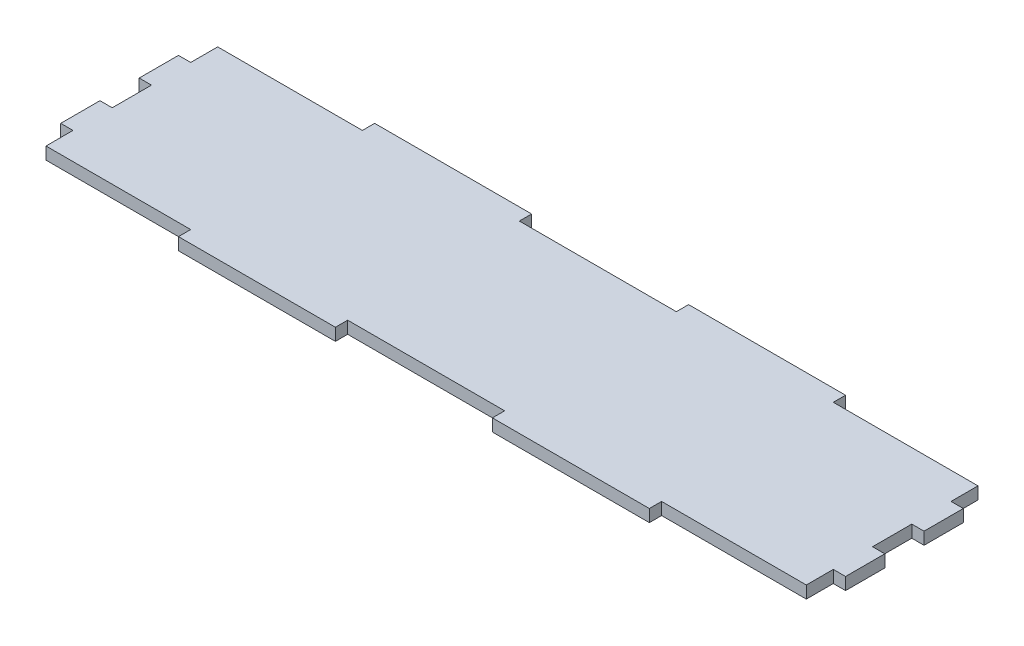
ISO-10303-21;
HEADER;
FILE_DESCRIPTION(('STEP AP214'),'2;1');
FILE_NAME('part.step','',(''),(''),'','','');
FILE_SCHEMA(('AUTOMOTIVE_DESIGN { 1 0 10303 214 1 1 1 1 }'));
ENDSEC;
DATA;
#1=APPLICATION_CONTEXT('core data for automotive mechanical design processes');
#2=APPLICATION_PROTOCOL_DEFINITION('international standard','automotive_design',2000,#1);
#3=PRODUCT_CONTEXT('',#1,'mechanical');
#4=PRODUCT('Part','Part','',(#3));
#5=PRODUCT_RELATED_PRODUCT_CATEGORY('part','',(#4));
#6=PRODUCT_DEFINITION_FORMATION('','',#4);
#7=PRODUCT_DEFINITION_CONTEXT('part definition',#1,'design');
#8=PRODUCT_DEFINITION('design','',#6,#7);
#9=PRODUCT_DEFINITION_SHAPE('','',#8);
#10=(LENGTH_UNIT() NAMED_UNIT(*) SI_UNIT(.MILLI.,.METRE.));
#11=(NAMED_UNIT(*) PLANE_ANGLE_UNIT() SI_UNIT($,.RADIAN.));
#12=(NAMED_UNIT(*) SI_UNIT($,.STERADIAN.) SOLID_ANGLE_UNIT());
#13=UNCERTAINTY_MEASURE_WITH_UNIT(LENGTH_MEASURE(1.E-05),#10,'distance_accuracy_value','');
#14=(GEOMETRIC_REPRESENTATION_CONTEXT(3) GLOBAL_UNCERTAINTY_ASSIGNED_CONTEXT((#13)) GLOBAL_UNIT_ASSIGNED_CONTEXT((#10,
#11,#12)) REPRESENTATION_CONTEXT('',''));
#15=CARTESIAN_POINT('',(0.,0.,0.));
#16=DIRECTION('',(0.,0.,1.));
#17=DIRECTION('',(1.,0.,0.));
#18=AXIS2_PLACEMENT_3D('',#15,#16,#17);
#19=CARTESIAN_POINT('',(101.6,3.175,25.4));
#20=DIRECTION('',(-1.,0.,0.));
#21=DIRECTION('',(0.,0.,1.));
#22=AXIS2_PLACEMENT_3D('',#19,#20,#21);
#23=PLANE('',#22);
#24=DIRECTION('',(0.,0.,-1.));
#25=VECTOR('',#24,1.);
#26=CARTESIAN_POINT('',(101.6,3.175,25.4));
#27=LINE('',#26,#25);
#28=CARTESIAN_POINT('',(101.6,3.175,15.24));
#29=VERTEX_POINT('',#28);
#30=CARTESIAN_POINT('',(101.6,3.175,5.07999999999621));
#31=VERTEX_POINT('',#30);
#32=EDGE_CURVE('E398',#29,#31,#27,.T.);
#33=ORIENTED_EDGE('',*,*,#32,.F.);
#34=DIRECTION('',(0.,1.,0.));
#35=VECTOR('',#34,1.);
#36=CARTESIAN_POINT('',(101.6,0.,15.24));
#37=LINE('',#36,#35);
#38=CARTESIAN_POINT('',(101.6,0.,15.24));
#39=VERTEX_POINT('',#38);
#40=EDGE_CURVE('E465',#39,#29,#37,.T.);
#41=ORIENTED_EDGE('',*,*,#40,.F.);
#42=DIRECTION('',(0.,0.,-1.));
#43=VECTOR('',#42,1.);
#44=CARTESIAN_POINT('',(101.6,0.,25.4));
#45=LINE('',#44,#43);
#46=CARTESIAN_POINT('',(101.6,0.,5.07999999999621));
#47=VERTEX_POINT('',#46);
#48=EDGE_CURVE('E407',#39,#47,#45,.T.);
#49=ORIENTED_EDGE('',*,*,#48,.T.);
#50=DIRECTION('',(0.,1.,0.));
#51=VECTOR('',#50,1.);
#52=CARTESIAN_POINT('',(101.6,0.,5.07999999999621));
#53=LINE('',#52,#51);
#54=EDGE_CURVE('E484',#47,#31,#53,.T.);
#55=ORIENTED_EDGE('',*,*,#54,.T.);
#56=EDGE_LOOP('',(#33,#41,#49,#55));
#57=FACE_BOUND('',#56,.T.);
#58=ADVANCED_FACE('F34',(#57),#23,.F.);
#59=CARTESIAN_POINT('',(-101.6,3.175,25.4));
#60=DIRECTION('',(1.,0.,0.));
#61=DIRECTION('',(0.,0.,-1.));
#62=AXIS2_PLACEMENT_3D('',#59,#60,#61);
#63=PLANE('',#62);
#64=DIRECTION('',(0.,0.,1.));
#65=VECTOR('',#64,1.);
#66=CARTESIAN_POINT('',(-101.6,3.175,25.4));
#67=LINE('',#66,#65);
#68=CARTESIAN_POINT('',(-101.6,3.175,-15.24));
#69=VERTEX_POINT('',#68);
#70=CARTESIAN_POINT('',(-101.6,3.175,-5.08));
#71=VERTEX_POINT('',#70);
#72=EDGE_CURVE('E284',#69,#71,#67,.T.);
#73=ORIENTED_EDGE('',*,*,#72,.F.);
#74=DIRECTION('',(0.,1.,0.));
#75=VECTOR('',#74,1.);
#76=CARTESIAN_POINT('',(-101.6,0.,-15.24));
#77=LINE('',#76,#75);
#78=CARTESIAN_POINT('',(-101.6,0.,-15.24));
#79=VERTEX_POINT('',#78);
#80=EDGE_CURVE('E269',#79,#69,#77,.T.);
#81=ORIENTED_EDGE('',*,*,#80,.F.);
#82=DIRECTION('',(0.,0.,1.));
#83=VECTOR('',#82,1.);
#84=CARTESIAN_POINT('',(-101.6,0.,25.4));
#85=LINE('',#84,#83);
#86=CARTESIAN_POINT('',(-101.6,0.,-5.08));
#87=VERTEX_POINT('',#86);
#88=EDGE_CURVE('E282',#79,#87,#85,.T.);
#89=ORIENTED_EDGE('',*,*,#88,.T.);
#90=DIRECTION('',(0.,1.,0.));
#91=VECTOR('',#90,1.);
#92=CARTESIAN_POINT('',(-101.6,0.,-5.08));
#93=LINE('',#92,#91);
#94=EDGE_CURVE('E489',#87,#71,#93,.T.);
#95=ORIENTED_EDGE('',*,*,#94,.T.);
#96=EDGE_LOOP('',(#73,#81,#89,#95));
#97=FACE_BOUND('',#96,.T.);
#98=ADVANCED_FACE('F280',(#97),#63,.F.);
#99=CARTESIAN_POINT('',(-101.6,3.175,-25.4));
#100=DIRECTION('',(0.,0.,1.));
#101=DIRECTION('',(1.,0.,0.));
#102=AXIS2_PLACEMENT_3D('',#99,#100,#101);
#103=PLANE('',#102);
#104=DIRECTION('',(-1.,0.,0.));
#105=VECTOR('',#104,1.);
#106=CARTESIAN_POINT('',(-101.6,3.175,-25.4));
#107=LINE('',#106,#105);
#108=CARTESIAN_POINT('',(-20.32,3.175,-25.4));
#109=VERTEX_POINT('',#108);
#110=CARTESIAN_POINT('',(-60.96,3.175,-25.4));
#111=VERTEX_POINT('',#110);
#112=EDGE_CURVE('E400',#109,#111,#107,.T.);
#113=ORIENTED_EDGE('',*,*,#112,.F.);
#114=DIRECTION('',(0.,1.,0.));
#115=VECTOR('',#114,1.);
#116=CARTESIAN_POINT('',(-20.32,0.,-25.4));
#117=LINE('',#116,#115);
#118=CARTESIAN_POINT('',(-20.32,0.,-25.4));
#119=VERTEX_POINT('',#118);
#120=EDGE_CURVE('E357',#119,#109,#117,.T.);
#121=ORIENTED_EDGE('',*,*,#120,.F.);
#122=DIRECTION('',(-1.,0.,0.));
#123=VECTOR('',#122,1.);
#124=CARTESIAN_POINT('',(-101.6,0.,-25.4));
#125=LINE('',#124,#123);
#126=CARTESIAN_POINT('',(-60.96,0.,-25.4));
#127=VERTEX_POINT('',#126);
#128=EDGE_CURVE('E300',#119,#127,#125,.T.);
#129=ORIENTED_EDGE('',*,*,#128,.T.);
#130=DIRECTION('',(0.,1.,0.));
#131=VECTOR('',#130,1.);
#132=CARTESIAN_POINT('',(-60.96,0.,-25.4));
#133=LINE('',#132,#131);
#134=EDGE_CURVE('E378',#127,#111,#133,.T.);
#135=ORIENTED_EDGE('',*,*,#134,.T.);
#136=EDGE_LOOP('',(#113,#121,#129,#135));
#137=FACE_BOUND('',#136,.T.);
#138=ADVANCED_FACE('F626',(#137),#103,.F.);
#139=CARTESIAN_POINT('',(-101.6,3.175,25.4));
#140=DIRECTION('',(0.,0.,-1.));
#141=DIRECTION('',(-1.,0.,0.));
#142=AXIS2_PLACEMENT_3D('',#139,#140,#141);
#143=PLANE('',#142);
#144=DIRECTION('',(1.,0.,0.));
#145=VECTOR('',#144,1.);
#146=CARTESIAN_POINT('',(-101.6,0.,25.4));
#147=LINE('',#146,#145);
#148=CARTESIAN_POINT('',(-60.96,0.,25.4));
#149=VERTEX_POINT('',#148);
#150=CARTESIAN_POINT('',(-20.32,0.,25.4));
#151=VERTEX_POINT('',#150);
#152=EDGE_CURVE('E295',#149,#151,#147,.T.);
#153=ORIENTED_EDGE('',*,*,#152,.T.);
#154=DIRECTION('',(0.,1.,0.));
#155=VECTOR('',#154,1.);
#156=CARTESIAN_POINT('',(-20.32,0.,25.4));
#157=LINE('',#156,#155);
#158=CARTESIAN_POINT('',(-20.32,3.175,25.4));
#159=VERTEX_POINT('',#158);
#160=EDGE_CURVE('E540',#151,#159,#157,.T.);
#161=ORIENTED_EDGE('',*,*,#160,.T.);
#162=DIRECTION('',(1.,0.,0.));
#163=VECTOR('',#162,1.);
#164=CARTESIAN_POINT('',(-101.6,3.175,25.4));
#165=LINE('',#164,#163);
#166=CARTESIAN_POINT('',(-60.96,3.175,25.4));
#167=VERTEX_POINT('',#166);
#168=EDGE_CURVE('E309',#167,#159,#165,.T.);
#169=ORIENTED_EDGE('',*,*,#168,.F.);
#170=DIRECTION('',(0.,1.,0.));
#171=VECTOR('',#170,1.);
#172=CARTESIAN_POINT('',(-60.96,0.,25.4));
#173=LINE('',#172,#171);
#174=EDGE_CURVE('E391',#149,#167,#173,.T.);
#175=ORIENTED_EDGE('',*,*,#174,.F.);
#176=EDGE_LOOP('',(#153,#161,#169,#175));
#177=FACE_BOUND('',#176,.T.);
#178=ADVANCED_FACE('F554',(#177),#143,.F.);
#179=CARTESIAN_POINT('',(101.6,0.,-5.08));
#180=VERTEX_POINT('',#179);
#181=CARTESIAN_POINT('',(101.6,0.,-15.2400000000038));
#182=VERTEX_POINT('',#181);
#183=EDGE_CURVE('E381',#180,#182,#45,.T.);
#184=ORIENTED_EDGE('',*,*,#183,.T.);
#185=DIRECTION('',(0.,1.,0.));
#186=VECTOR('',#185,1.);
#187=CARTESIAN_POINT('',(101.6,0.,-15.2400000000038));
#188=LINE('',#187,#186);
#189=CARTESIAN_POINT('',(101.6,3.175,-15.2400000000038));
#190=VERTEX_POINT('',#189);
#191=EDGE_CURVE('E419',#182,#190,#188,.T.);
#192=ORIENTED_EDGE('',*,*,#191,.T.);
#193=CARTESIAN_POINT('',(101.6,3.175,-5.08));
#194=VERTEX_POINT('',#193);
#195=EDGE_CURVE('E304',#194,#190,#27,.T.);
#196=ORIENTED_EDGE('',*,*,#195,.F.);
#197=DIRECTION('',(0.,1.,0.));
#198=VECTOR('',#197,1.);
#199=CARTESIAN_POINT('',(101.6,0.,-5.08));
#200=LINE('',#199,#198);
#201=EDGE_CURVE('E421',#180,#194,#200,.T.);
#202=ORIENTED_EDGE('',*,*,#201,.F.);
#203=EDGE_LOOP('',(#184,#192,#196,#202));
#204=FACE_BOUND('',#203,.T.);
#205=ADVANCED_FACE('F36',(#204),#23,.F.);
#206=CARTESIAN_POINT('',(60.96,3.175,-25.4));
#207=VERTEX_POINT('',#206);
#208=CARTESIAN_POINT('',(20.32,3.175,-25.4));
#209=VERTEX_POINT('',#208);
#210=EDGE_CURVE('E402',#207,#209,#107,.T.);
#211=ORIENTED_EDGE('',*,*,#210,.F.);
#212=DIRECTION('',(0.,1.,0.));
#213=VECTOR('',#212,1.);
#214=CARTESIAN_POINT('',(60.96,0.,-25.4));
#215=LINE('',#214,#213);
#216=CARTESIAN_POINT('',(60.96,0.,-25.4));
#217=VERTEX_POINT('',#216);
#218=EDGE_CURVE('E326',#217,#207,#215,.T.);
#219=ORIENTED_EDGE('',*,*,#218,.F.);
#220=CARTESIAN_POINT('',(20.32,0.,-25.4));
#221=VERTEX_POINT('',#220);
#222=EDGE_CURVE('E298',#217,#221,#125,.T.);
#223=ORIENTED_EDGE('',*,*,#222,.T.);
#224=DIRECTION('',(0.,1.,0.));
#225=VECTOR('',#224,1.);
#226=CARTESIAN_POINT('',(20.32,0.,-25.4));
#227=LINE('',#226,#225);
#228=EDGE_CURVE('E360',#221,#209,#227,.T.);
#229=ORIENTED_EDGE('',*,*,#228,.T.);
#230=EDGE_LOOP('',(#211,#219,#223,#229));
#231=FACE_BOUND('',#230,.T.);
#232=ADVANCED_FACE('F630',(#231),#103,.F.);
#233=CARTESIAN_POINT('',(-101.6,0.,5.08));
#234=VERTEX_POINT('',#233);
#235=CARTESIAN_POINT('',(-101.6,0.,15.24));
#236=VERTEX_POINT('',#235);
#237=EDGE_CURVE('E292',#234,#236,#85,.T.);
#238=ORIENTED_EDGE('',*,*,#237,.T.);
#239=DIRECTION('',(0.,1.,0.));
#240=VECTOR('',#239,1.);
#241=CARTESIAN_POINT('',(-101.6,0.,15.24));
#242=LINE('',#241,#240);
#243=CARTESIAN_POINT('',(-101.6,3.175,15.24));
#244=VERTEX_POINT('',#243);
#245=EDGE_CURVE('E452',#236,#244,#242,.T.);
#246=ORIENTED_EDGE('',*,*,#245,.T.);
#247=CARTESIAN_POINT('',(-101.6,3.175,5.08));
#248=VERTEX_POINT('',#247);
#249=EDGE_CURVE('E405',#248,#244,#67,.T.);
#250=ORIENTED_EDGE('',*,*,#249,.F.);
#251=DIRECTION('',(0.,1.,0.));
#252=VECTOR('',#251,1.);
#253=CARTESIAN_POINT('',(-101.6,0.,5.08));
#254=LINE('',#253,#252);
#255=EDGE_CURVE('E479',#234,#248,#254,.T.);
#256=ORIENTED_EDGE('',*,*,#255,.F.);
#257=EDGE_LOOP('',(#238,#246,#250,#256));
#258=FACE_BOUND('',#257,.T.);
#259=ADVANCED_FACE('F628',(#258),#63,.F.);
#260=CARTESIAN_POINT('',(20.32,3.175,25.4));
#261=VERTEX_POINT('',#260);
#262=CARTESIAN_POINT('',(60.96,3.175,25.4));
#263=VERTEX_POINT('',#262);
#264=EDGE_CURVE('E404',#261,#263,#165,.T.);
#265=ORIENTED_EDGE('',*,*,#264,.F.);
#266=DIRECTION('',(0.,1.,0.));
#267=VECTOR('',#266,1.);
#268=CARTESIAN_POINT('',(20.32,0.,25.4));
#269=LINE('',#268,#267);
#270=CARTESIAN_POINT('',(20.32,0.,25.4));
#271=VERTEX_POINT('',#270);
#272=EDGE_CURVE('E550',#271,#261,#269,.T.);
#273=ORIENTED_EDGE('',*,*,#272,.F.);
#274=CARTESIAN_POINT('',(60.96,0.,25.4));
#275=VERTEX_POINT('',#274);
#276=EDGE_CURVE('E291',#271,#275,#147,.T.);
#277=ORIENTED_EDGE('',*,*,#276,.T.);
#278=DIRECTION('',(0.,1.,0.));
#279=VECTOR('',#278,1.);
#280=CARTESIAN_POINT('',(60.96,0.,25.4));
#281=LINE('',#280,#279);
#282=EDGE_CURVE('E523',#275,#263,#281,.T.);
#283=ORIENTED_EDGE('',*,*,#282,.T.);
#284=EDGE_LOOP('',(#265,#273,#277,#283));
#285=FACE_BOUND('',#284,.T.);
#286=ADVANCED_FACE('F581',(#285),#143,.F.);
#287=CARTESIAN_POINT('',(0.,3.175,0.));
#288=DIRECTION('',(0.,-1.,0.));
#289=DIRECTION('',(0.,0.,-1.));
#290=AXIS2_PLACEMENT_3D('',#287,#288,#289);
#291=PLANE('',#290);
#292=DIRECTION('',(1.,0.,0.));
#293=VECTOR('',#292,1.);
#294=CARTESIAN_POINT('',(-101.6,3.175,-22.225));
#295=LINE('',#294,#293);
#296=CARTESIAN_POINT('',(-98.425,3.175,-22.225));
#297=VERTEX_POINT('',#296);
#298=CARTESIAN_POINT('',(-60.96,3.175,-22.225));
#299=VERTEX_POINT('',#298);
#300=EDGE_CURVE('E373',#297,#299,#295,.T.);
#301=ORIENTED_EDGE('',*,*,#300,.F.);
#302=DIRECTION('',(0.,0.,-1.));
#303=VECTOR('',#302,1.);
#304=CARTESIAN_POINT('',(-98.425,3.175,-25.4));
#305=LINE('',#304,#303);
#306=CARTESIAN_POINT('',(-98.425,3.175,-15.24));
#307=VERTEX_POINT('',#306);
#308=EDGE_CURVE('E49',#307,#297,#305,.T.);
#309=ORIENTED_EDGE('',*,*,#308,.F.);
#310=DIRECTION('',(1.,0.,0.));
#311=VECTOR('',#310,1.);
#312=CARTESIAN_POINT('',(-101.6,3.175,-15.24));
#313=LINE('',#312,#311);
#314=EDGE_CURVE('E438',#69,#307,#313,.T.);
#315=ORIENTED_EDGE('',*,*,#314,.F.);
#316=ORIENTED_EDGE('',*,*,#72,.T.);
#317=DIRECTION('',(-1.,0.,0.));
#318=VECTOR('',#317,1.);
#319=CARTESIAN_POINT('',(-101.6,3.175,-5.08));
#320=LINE('',#319,#318);
#321=CARTESIAN_POINT('',(-98.425,3.175,-5.08));
#322=VERTEX_POINT('',#321);
#323=EDGE_CURVE('E476',#322,#71,#320,.T.);
#324=ORIENTED_EDGE('',*,*,#323,.F.);
#325=DIRECTION('',(0.,0.,-1.));
#326=VECTOR('',#325,1.);
#327=CARTESIAN_POINT('',(-98.425,3.175,-5.08));
#328=LINE('',#327,#326);
#329=CARTESIAN_POINT('',(-98.425,3.175,5.08));
#330=VERTEX_POINT('',#329);
#331=EDGE_CURVE('E483',#330,#322,#328,.T.);
#332=ORIENTED_EDGE('',*,*,#331,.F.);
#333=DIRECTION('',(1.,0.,0.));
#334=VECTOR('',#333,1.);
#335=CARTESIAN_POINT('',(-101.6,3.175,5.08));
#336=LINE('',#335,#334);
#337=EDGE_CURVE('E480',#248,#330,#336,.T.);
#338=ORIENTED_EDGE('',*,*,#337,.F.);
#339=ORIENTED_EDGE('',*,*,#249,.T.);
#340=DIRECTION('',(-1.,0.,0.));
#341=VECTOR('',#340,1.);
#342=CARTESIAN_POINT('',(-101.6,3.175,15.24));
#343=LINE('',#342,#341);
#344=CARTESIAN_POINT('',(-98.425,3.175,15.24));
#345=VERTEX_POINT('',#344);
#346=EDGE_CURVE('E444',#345,#244,#343,.T.);
#347=ORIENTED_EDGE('',*,*,#346,.F.);
#348=DIRECTION('',(0.,0.,-1.));
#349=VECTOR('',#348,1.);
#350=CARTESIAN_POINT('',(-98.425,3.175,15.24));
#351=LINE('',#350,#349);
#352=CARTESIAN_POINT('',(-98.425,3.175,22.225));
#353=VERTEX_POINT('',#352);
#354=EDGE_CURVE('E448',#353,#345,#351,.T.);
#355=ORIENTED_EDGE('',*,*,#354,.F.);
#356=DIRECTION('',(-1.,0.,0.));
#357=VECTOR('',#356,1.);
#358=CARTESIAN_POINT('',(-101.6,3.175,22.225));
#359=LINE('',#358,#357);
#360=CARTESIAN_POINT('',(-60.96,3.175,22.225));
#361=VERTEX_POINT('',#360);
#362=EDGE_CURVE('E388',#361,#353,#359,.T.);
#363=ORIENTED_EDGE('',*,*,#362,.F.);
#364=DIRECTION('',(0.,0.,-1.));
#365=VECTOR('',#364,1.);
#366=CARTESIAN_POINT('',(-60.96,3.175,25.4));
#367=LINE('',#366,#365);
#368=EDGE_CURVE('E359',#167,#361,#367,.T.);
#369=ORIENTED_EDGE('',*,*,#368,.F.);
#370=ORIENTED_EDGE('',*,*,#168,.T.);
#371=DIRECTION('',(0.,0.,1.));
#372=VECTOR('',#371,1.);
#373=CARTESIAN_POINT('',(-20.32,3.175,25.4));
#374=LINE('',#373,#372);
#375=CARTESIAN_POINT('',(-20.32,3.175,22.225));
#376=VERTEX_POINT('',#375);
#377=EDGE_CURVE('E336',#376,#159,#374,.T.);
#378=ORIENTED_EDGE('',*,*,#377,.F.);
#379=DIRECTION('',(-1.,0.,0.));
#380=VECTOR('',#379,1.);
#381=CARTESIAN_POINT('',(-20.32,3.175,22.225));
#382=LINE('',#381,#380);
#383=CARTESIAN_POINT('',(20.32,3.175,22.225));
#384=VERTEX_POINT('',#383);
#385=EDGE_CURVE('E534',#384,#376,#382,.T.);
#386=ORIENTED_EDGE('',*,*,#385,.F.);
#387=DIRECTION('',(0.,0.,-1.));
#388=VECTOR('',#387,1.);
#389=CARTESIAN_POINT('',(20.32,3.175,25.4));
#390=LINE('',#389,#388);
#391=EDGE_CURVE('E542',#261,#384,#390,.T.);
#392=ORIENTED_EDGE('',*,*,#391,.F.);
#393=ORIENTED_EDGE('',*,*,#264,.T.);
#394=DIRECTION('',(0.,0.,1.));
#395=VECTOR('',#394,1.);
#396=CARTESIAN_POINT('',(60.96,3.175,25.4));
#397=LINE('',#396,#395);
#398=CARTESIAN_POINT('',(60.96,3.175,22.225));
#399=VERTEX_POINT('',#398);
#400=EDGE_CURVE('E491',#399,#263,#397,.T.);
#401=ORIENTED_EDGE('',*,*,#400,.F.);
#402=DIRECTION('',(-1.,0.,0.));
#403=VECTOR('',#402,1.);
#404=CARTESIAN_POINT('',(60.96,3.175,22.225));
#405=LINE('',#404,#403);
#406=CARTESIAN_POINT('',(98.425,3.175,22.225));
#407=VERTEX_POINT('',#406);
#408=EDGE_CURVE('E521',#407,#399,#405,.T.);
#409=ORIENTED_EDGE('',*,*,#408,.F.);
#410=DIRECTION('',(0.,0.,1.));
#411=VECTOR('',#410,1.);
#412=CARTESIAN_POINT('',(98.425,3.175,25.3999999999962));
#413=LINE('',#412,#411);
#414=CARTESIAN_POINT('',(98.425,3.175,15.24));
#415=VERTEX_POINT('',#414);
#416=EDGE_CURVE('E462',#415,#407,#413,.T.);
#417=ORIENTED_EDGE('',*,*,#416,.F.);
#418=DIRECTION('',(-1.,0.,0.));
#419=VECTOR('',#418,1.);
#420=CARTESIAN_POINT('',(101.6,3.175,15.24));
#421=LINE('',#420,#419);
#422=EDGE_CURVE('E466',#29,#415,#421,.T.);
#423=ORIENTED_EDGE('',*,*,#422,.F.);
#424=ORIENTED_EDGE('',*,*,#32,.T.);
#425=DIRECTION('',(1.,0.,0.));
#426=VECTOR('',#425,1.);
#427=CARTESIAN_POINT('',(101.6,3.175,5.07999999999621));
#428=LINE('',#427,#426);
#429=CARTESIAN_POINT('',(98.425,3.175,5.07999999999621));
#430=VERTEX_POINT('',#429);
#431=EDGE_CURVE('E499',#430,#31,#428,.T.);
#432=ORIENTED_EDGE('',*,*,#431,.F.);
#433=DIRECTION('',(0.,0.,1.));
#434=VECTOR('',#433,1.);
#435=CARTESIAN_POINT('',(98.425,3.175,5.07999999999621));
#436=LINE('',#435,#434);
#437=CARTESIAN_POINT('',(98.425,3.175,-5.08));
#438=VERTEX_POINT('',#437);
#439=EDGE_CURVE('E506',#438,#430,#436,.T.);
#440=ORIENTED_EDGE('',*,*,#439,.F.);
#441=DIRECTION('',(-1.,0.,0.));
#442=VECTOR('',#441,1.);
#443=CARTESIAN_POINT('',(101.6,3.175,-5.08));
#444=LINE('',#443,#442);
#445=EDGE_CURVE('E455',#194,#438,#444,.T.);
#446=ORIENTED_EDGE('',*,*,#445,.F.);
#447=ORIENTED_EDGE('',*,*,#195,.T.);
#448=DIRECTION('',(1.,0.,0.));
#449=VECTOR('',#448,1.);
#450=CARTESIAN_POINT('',(101.6,3.175,-15.2400000000038));
#451=LINE('',#450,#449);
#452=CARTESIAN_POINT('',(98.425,3.175,-15.2400000000038));
#453=VERTEX_POINT('',#452);
#454=EDGE_CURVE('E432',#453,#190,#451,.T.);
#455=ORIENTED_EDGE('',*,*,#454,.F.);
#456=DIRECTION('',(0.,0.,1.));
#457=VECTOR('',#456,1.);
#458=CARTESIAN_POINT('',(98.425,3.175,-15.2400000000038));
#459=LINE('',#458,#457);
#460=CARTESIAN_POINT('',(98.425,3.175,-22.225));
#461=VERTEX_POINT('',#460);
#462=EDGE_CURVE('E435',#461,#453,#459,.T.);
#463=ORIENTED_EDGE('',*,*,#462,.F.);
#464=DIRECTION('',(1.,0.,0.));
#465=VECTOR('',#464,1.);
#466=CARTESIAN_POINT('',(60.96,3.175,-22.225));
#467=LINE('',#466,#465);
#468=CARTESIAN_POINT('',(60.96,3.175,-22.225));
#469=VERTEX_POINT('',#468);
#470=EDGE_CURVE('E319',#469,#461,#467,.T.);
#471=ORIENTED_EDGE('',*,*,#470,.F.);
#472=DIRECTION('',(0.,0.,1.));
#473=VECTOR('',#472,1.);
#474=CARTESIAN_POINT('',(60.96,3.175,-25.4));
#475=LINE('',#474,#473);
#476=EDGE_CURVE('E331',#207,#469,#475,.T.);
#477=ORIENTED_EDGE('',*,*,#476,.F.);
#478=ORIENTED_EDGE('',*,*,#210,.T.);
#479=DIRECTION('',(0.,0.,-1.));
#480=VECTOR('',#479,1.);
#481=CARTESIAN_POINT('',(20.32,3.175,-25.4));
#482=LINE('',#481,#480);
#483=CARTESIAN_POINT('',(20.32,3.175,-22.225));
#484=VERTEX_POINT('',#483);
#485=EDGE_CURVE('E342',#484,#209,#482,.T.);
#486=ORIENTED_EDGE('',*,*,#485,.F.);
#487=DIRECTION('',(1.,0.,0.));
#488=VECTOR('',#487,1.);
#489=CARTESIAN_POINT('',(-20.32,3.175,-22.225));
#490=LINE('',#489,#488);
#491=CARTESIAN_POINT('',(-20.32,3.175,-22.225));
#492=VERTEX_POINT('',#491);
#493=EDGE_CURVE('E352',#492,#484,#490,.T.);
#494=ORIENTED_EDGE('',*,*,#493,.F.);
#495=DIRECTION('',(0.,0.,1.));
#496=VECTOR('',#495,1.);
#497=CARTESIAN_POINT('',(-20.32,3.175,-25.4));
#498=LINE('',#497,#496);
#499=EDGE_CURVE('E349',#109,#492,#498,.T.);
#500=ORIENTED_EDGE('',*,*,#499,.F.);
#501=ORIENTED_EDGE('',*,*,#112,.T.);
#502=DIRECTION('',(0.,0.,-1.));
#503=VECTOR('',#502,1.);
#504=CARTESIAN_POINT('',(-60.96,3.175,-25.4));
#505=LINE('',#504,#503);
#506=EDGE_CURVE('E369',#299,#111,#505,.T.);
#507=ORIENTED_EDGE('',*,*,#506,.F.);
#508=EDGE_LOOP('',(#301,#309,#315,#316,#324,#332,#338,#339,#347,#355,#363,#369,#370,#378,#386,
#392,#393,#401,#409,#417,#423,#424,#432,#440,#446,#447,#455,#463,#471,#477,#478,#486,#494,#500,
#501,#507));
#509=FACE_BOUND('',#508,.T.);
#510=ADVANCED_FACE('F563',(#509),#291,.F.);
#511=CARTESIAN_POINT('',(0.,0.,0.));
#512=DIRECTION('',(0.,-1.,0.));
#513=DIRECTION('',(0.,0.,-1.));
#514=AXIS2_PLACEMENT_3D('',#511,#512,#513);
#515=PLANE('',#514);
#516=DIRECTION('',(0.,0.,-1.));
#517=VECTOR('',#516,1.);
#518=CARTESIAN_POINT('',(-98.425,0.,-25.4));
#519=LINE('',#518,#517);
#520=CARTESIAN_POINT('',(-98.425,0.,-15.24));
#521=VERTEX_POINT('',#520);
#522=CARTESIAN_POINT('',(-98.425,0.,-22.225));
#523=VERTEX_POINT('',#522);
#524=EDGE_CURVE('E276',#521,#523,#519,.T.);
#525=ORIENTED_EDGE('',*,*,#524,.T.);
#526=DIRECTION('',(1.,0.,0.));
#527=VECTOR('',#526,1.);
#528=CARTESIAN_POINT('',(-101.6,0.,-22.225));
#529=LINE('',#528,#527);
#530=CARTESIAN_POINT('',(-60.96,0.,-22.225));
#531=VERTEX_POINT('',#530);
#532=EDGE_CURVE('E366',#523,#531,#529,.T.);
#533=ORIENTED_EDGE('',*,*,#532,.T.);
#534=DIRECTION('',(0.,0.,-1.));
#535=VECTOR('',#534,1.);
#536=CARTESIAN_POINT('',(-60.96,0.,-25.4));
#537=LINE('',#536,#535);
#538=EDGE_CURVE('E368',#531,#127,#537,.T.);
#539=ORIENTED_EDGE('',*,*,#538,.T.);
#540=ORIENTED_EDGE('',*,*,#128,.F.);
#541=DIRECTION('',(0.,0.,1.));
#542=VECTOR('',#541,1.);
#543=CARTESIAN_POINT('',(-20.32,0.,-25.4));
#544=LINE('',#543,#542);
#545=CARTESIAN_POINT('',(-20.32,0.,-22.225));
#546=VERTEX_POINT('',#545);
#547=EDGE_CURVE('E338',#119,#546,#544,.T.);
#548=ORIENTED_EDGE('',*,*,#547,.T.);
#549=DIRECTION('',(1.,0.,0.));
#550=VECTOR('',#549,1.);
#551=CARTESIAN_POINT('',(-20.32,0.,-22.225));
#552=LINE('',#551,#550);
#553=CARTESIAN_POINT('',(20.32,0.,-22.225));
#554=VERTEX_POINT('',#553);
#555=EDGE_CURVE('E341',#546,#554,#552,.T.);
#556=ORIENTED_EDGE('',*,*,#555,.T.);
#557=DIRECTION('',(0.,0.,-1.));
#558=VECTOR('',#557,1.);
#559=CARTESIAN_POINT('',(20.32,0.,-25.4));
#560=LINE('',#559,#558);
#561=EDGE_CURVE('E345',#554,#221,#560,.T.);
#562=ORIENTED_EDGE('',*,*,#561,.T.);
#563=ORIENTED_EDGE('',*,*,#222,.F.);
#564=DIRECTION('',(0.,0.,1.));
#565=VECTOR('',#564,1.);
#566=CARTESIAN_POINT('',(60.96,0.,-25.4));
#567=LINE('',#566,#565);
#568=CARTESIAN_POINT('',(60.96,0.,-22.225));
#569=VERTEX_POINT('',#568);
#570=EDGE_CURVE('E323',#217,#569,#567,.T.);
#571=ORIENTED_EDGE('',*,*,#570,.T.);
#572=DIRECTION('',(1.,0.,0.));
#573=VECTOR('',#572,1.);
#574=CARTESIAN_POINT('',(60.96,0.,-22.225));
#575=LINE('',#574,#573);
#576=CARTESIAN_POINT('',(98.425,0.,-22.225));
#577=VERTEX_POINT('',#576);
#578=EDGE_CURVE('E316',#569,#577,#575,.T.);
#579=ORIENTED_EDGE('',*,*,#578,.T.);
#580=DIRECTION('',(0.,0.,1.));
#581=VECTOR('',#580,1.);
#582=CARTESIAN_POINT('',(98.425,0.,-15.2400000000038));
#583=LINE('',#582,#581);
#584=CARTESIAN_POINT('',(98.425,0.,-15.2400000000038));
#585=VERTEX_POINT('',#584);
#586=EDGE_CURVE('E56',#577,#585,#583,.T.);
#587=ORIENTED_EDGE('',*,*,#586,.T.);
#588=DIRECTION('',(1.,0.,0.));
#589=VECTOR('',#588,1.);
#590=CARTESIAN_POINT('',(101.6,0.,-15.2400000000038));
#591=LINE('',#590,#589);
#592=EDGE_CURVE('E426',#585,#182,#591,.T.);
#593=ORIENTED_EDGE('',*,*,#592,.T.);
#594=ORIENTED_EDGE('',*,*,#183,.F.);
#595=DIRECTION('',(-1.,0.,0.));
#596=VECTOR('',#595,1.);
#597=CARTESIAN_POINT('',(101.6,0.,-5.08));
#598=LINE('',#597,#596);
#599=CARTESIAN_POINT('',(98.425,0.,-5.08));
#600=VERTEX_POINT('',#599);
#601=EDGE_CURVE('E424',#180,#600,#598,.T.);
#602=ORIENTED_EDGE('',*,*,#601,.T.);
#603=DIRECTION('',(0.,0.,1.));
#604=VECTOR('',#603,1.);
#605=CARTESIAN_POINT('',(98.425,0.,5.07999999999621));
#606=LINE('',#605,#604);
#607=CARTESIAN_POINT('',(98.425,0.,5.07999999999621));
#608=VERTEX_POINT('',#607);
#609=EDGE_CURVE('E498',#600,#608,#606,.T.);
#610=ORIENTED_EDGE('',*,*,#609,.T.);
#611=DIRECTION('',(1.,0.,0.));
#612=VECTOR('',#611,1.);
#613=CARTESIAN_POINT('',(101.6,0.,5.07999999999621));
#614=LINE('',#613,#612);
#615=EDGE_CURVE('E501',#608,#47,#614,.T.);
#616=ORIENTED_EDGE('',*,*,#615,.T.);
#617=ORIENTED_EDGE('',*,*,#48,.F.);
#618=DIRECTION('',(-1.,0.,0.));
#619=VECTOR('',#618,1.);
#620=CARTESIAN_POINT('',(101.6,0.,15.24));
#621=LINE('',#620,#619);
#622=CARTESIAN_POINT('',(98.425,0.,15.24));
#623=VERTEX_POINT('',#622);
#624=EDGE_CURVE('E458',#39,#623,#621,.T.);
#625=ORIENTED_EDGE('',*,*,#624,.T.);
#626=DIRECTION('',(0.,0.,1.));
#627=VECTOR('',#626,1.);
#628=CARTESIAN_POINT('',(98.425,0.,25.3999999999962));
#629=LINE('',#628,#627);
#630=CARTESIAN_POINT('',(98.425,0.,22.225));
#631=VERTEX_POINT('',#630);
#632=EDGE_CURVE('E461',#623,#631,#629,.T.);
#633=ORIENTED_EDGE('',*,*,#632,.T.);
#634=DIRECTION('',(-1.,0.,0.));
#635=VECTOR('',#634,1.);
#636=CARTESIAN_POINT('',(60.96,0.,22.225));
#637=LINE('',#636,#635);
#638=CARTESIAN_POINT('',(60.96,0.,22.225));
#639=VERTEX_POINT('',#638);
#640=EDGE_CURVE('E520',#631,#639,#637,.T.);
#641=ORIENTED_EDGE('',*,*,#640,.T.);
#642=DIRECTION('',(0.,0.,1.));
#643=VECTOR('',#642,1.);
#644=CARTESIAN_POINT('',(60.96,0.,25.4));
#645=LINE('',#644,#643);
#646=EDGE_CURVE('E517',#639,#275,#645,.T.);
#647=ORIENTED_EDGE('',*,*,#646,.T.);
#648=ORIENTED_EDGE('',*,*,#276,.F.);
#649=DIRECTION('',(0.,0.,-1.));
#650=VECTOR('',#649,1.);
#651=CARTESIAN_POINT('',(20.32,0.,25.4));
#652=LINE('',#651,#650);
#653=CARTESIAN_POINT('',(20.32,0.,22.225));
#654=VERTEX_POINT('',#653);
#655=EDGE_CURVE('E533',#271,#654,#652,.T.);
#656=ORIENTED_EDGE('',*,*,#655,.T.);
#657=DIRECTION('',(-1.,0.,0.));
#658=VECTOR('',#657,1.);
#659=CARTESIAN_POINT('',(-20.32,0.,22.225));
#660=LINE('',#659,#658);
#661=CARTESIAN_POINT('',(-20.32,0.,22.225));
#662=VERTEX_POINT('',#661);
#663=EDGE_CURVE('E537',#654,#662,#660,.T.);
#664=ORIENTED_EDGE('',*,*,#663,.T.);
#665=DIRECTION('',(0.,0.,1.));
#666=VECTOR('',#665,1.);
#667=CARTESIAN_POINT('',(-20.32,0.,25.4));
#668=LINE('',#667,#666);
#669=EDGE_CURVE('E530',#662,#151,#668,.T.);
#670=ORIENTED_EDGE('',*,*,#669,.T.);
#671=ORIENTED_EDGE('',*,*,#152,.F.);
#672=DIRECTION('',(0.,0.,-1.));
#673=VECTOR('',#672,1.);
#674=CARTESIAN_POINT('',(-60.96,0.,25.4));
#675=LINE('',#674,#673);
#676=CARTESIAN_POINT('',(-60.96,0.,22.225));
#677=VERTEX_POINT('',#676);
#678=EDGE_CURVE('E384',#149,#677,#675,.T.);
#679=ORIENTED_EDGE('',*,*,#678,.T.);
#680=DIRECTION('',(-1.,0.,0.));
#681=VECTOR('',#680,1.);
#682=CARTESIAN_POINT('',(-101.6,0.,22.225));
#683=LINE('',#682,#681);
#684=CARTESIAN_POINT('',(-98.425,0.,22.225));
#685=VERTEX_POINT('',#684);
#686=EDGE_CURVE('E387',#677,#685,#683,.T.);
#687=ORIENTED_EDGE('',*,*,#686,.T.);
#688=DIRECTION('',(0.,0.,-1.));
#689=VECTOR('',#688,1.);
#690=CARTESIAN_POINT('',(-98.425,0.,15.24));
#691=LINE('',#690,#689);
#692=CARTESIAN_POINT('',(-98.425,0.,15.24));
#693=VERTEX_POINT('',#692);
#694=EDGE_CURVE('E440',#685,#693,#691,.T.);
#695=ORIENTED_EDGE('',*,*,#694,.T.);
#696=DIRECTION('',(-1.,0.,0.));
#697=VECTOR('',#696,1.);
#698=CARTESIAN_POINT('',(-101.6,0.,15.24));
#699=LINE('',#698,#697);
#700=EDGE_CURVE('E443',#693,#236,#699,.T.);
#701=ORIENTED_EDGE('',*,*,#700,.T.);
#702=ORIENTED_EDGE('',*,*,#237,.F.);
#703=DIRECTION('',(1.,0.,0.));
#704=VECTOR('',#703,1.);
#705=CARTESIAN_POINT('',(-101.6,0.,5.08));
#706=LINE('',#705,#704);
#707=CARTESIAN_POINT('',(-98.425,0.,5.08));
#708=VERTEX_POINT('',#707);
#709=EDGE_CURVE('E472',#234,#708,#706,.T.);
#710=ORIENTED_EDGE('',*,*,#709,.T.);
#711=DIRECTION('',(0.,0.,-1.));
#712=VECTOR('',#711,1.);
#713=CARTESIAN_POINT('',(-98.425,0.,-5.08));
#714=LINE('',#713,#712);
#715=CARTESIAN_POINT('',(-98.425,0.,-5.08));
#716=VERTEX_POINT('',#715);
#717=EDGE_CURVE('E475',#708,#716,#714,.T.);
#718=ORIENTED_EDGE('',*,*,#717,.T.);
#719=DIRECTION('',(-1.,0.,0.));
#720=VECTOR('',#719,1.);
#721=CARTESIAN_POINT('',(-101.6,0.,-5.08));
#722=LINE('',#721,#720);
#723=EDGE_CURVE('E290',#716,#87,#722,.T.);
#724=ORIENTED_EDGE('',*,*,#723,.T.);
#725=ORIENTED_EDGE('',*,*,#88,.F.);
#726=DIRECTION('',(1.,0.,0.));
#727=VECTOR('',#726,1.);
#728=CARTESIAN_POINT('',(-101.6,0.,-15.24));
#729=LINE('',#728,#727);
#730=EDGE_CURVE('E265',#79,#521,#729,.T.);
#731=ORIENTED_EDGE('',*,*,#730,.T.);
#732=EDGE_LOOP('',(#525,#533,#539,#540,#548,#556,#562,#563,#571,#579,#587,#593,#594,#602,#610,
#616,#617,#625,#633,#641,#647,#648,#656,#664,#670,#671,#679,#687,#695,#701,#702,#710,#718,#724,
#725,#731));
#733=FACE_BOUND('',#732,.T.);
#734=ADVANCED_FACE('F287',(#733),#515,.T.);
#735=CARTESIAN_POINT('',(-101.6,0.,22.225));
#736=DIRECTION('',(0.,0.,-1.));
#737=DIRECTION('',(-1.,0.,0.));
#738=AXIS2_PLACEMENT_3D('',#735,#736,#737);
#739=PLANE('',#738);
#740=ORIENTED_EDGE('',*,*,#362,.T.);
#741=DIRECTION('',(0.,-1.,0.));
#742=VECTOR('',#741,1.);
#743=CARTESIAN_POINT('',(-98.425,0.,22.225));
#744=LINE('',#743,#742);
#745=EDGE_CURVE('E308',#353,#685,#744,.T.);
#746=ORIENTED_EDGE('',*,*,#745,.T.);
#747=ORIENTED_EDGE('',*,*,#686,.F.);
#748=DIRECTION('',(0.,1.,0.));
#749=VECTOR('',#748,1.);
#750=CARTESIAN_POINT('',(-60.96,0.,22.225));
#751=LINE('',#750,#749);
#752=EDGE_CURVE('E375',#677,#361,#751,.T.);
#753=ORIENTED_EDGE('',*,*,#752,.T.);
#754=EDGE_LOOP('',(#740,#746,#747,#753));
#755=FACE_BOUND('',#754,.T.);
#756=ADVANCED_FACE('F754',(#755),#739,.F.);
#757=CARTESIAN_POINT('',(-60.96,0.,25.4));
#758=DIRECTION('',(1.,0.,0.));
#759=DIRECTION('',(0.,0.,-1.));
#760=AXIS2_PLACEMENT_3D('',#757,#758,#759);
#761=PLANE('',#760);
#762=ORIENTED_EDGE('',*,*,#368,.T.);
#763=ORIENTED_EDGE('',*,*,#752,.F.);
#764=ORIENTED_EDGE('',*,*,#678,.F.);
#765=ORIENTED_EDGE('',*,*,#174,.T.);
#766=EDGE_LOOP('',(#762,#763,#764,#765));
#767=FACE_BOUND('',#766,.T.);
#768=ADVANCED_FACE('F569',(#767),#761,.F.);
#769=CARTESIAN_POINT('',(-60.96,0.,-25.4));
#770=DIRECTION('',(1.,0.,0.));
#771=DIRECTION('',(0.,0.,-1.));
#772=AXIS2_PLACEMENT_3D('',#769,#770,#771);
#773=PLANE('',#772);
#774=ORIENTED_EDGE('',*,*,#506,.T.);
#775=ORIENTED_EDGE('',*,*,#134,.F.);
#776=ORIENTED_EDGE('',*,*,#538,.F.);
#777=DIRECTION('',(0.,1.,0.));
#778=VECTOR('',#777,1.);
#779=CARTESIAN_POINT('',(-60.96,0.,-22.225));
#780=LINE('',#779,#778);
#781=EDGE_CURVE('E372',#531,#299,#780,.T.);
#782=ORIENTED_EDGE('',*,*,#781,.T.);
#783=EDGE_LOOP('',(#774,#775,#776,#782));
#784=FACE_BOUND('',#783,.T.);
#785=ADVANCED_FACE('F683',(#784),#773,.F.);
#786=CARTESIAN_POINT('',(-101.6,0.,-22.225));
#787=DIRECTION('',(0.,0.,1.));
#788=DIRECTION('',(1.,0.,0.));
#789=AXIS2_PLACEMENT_3D('',#786,#787,#788);
#790=PLANE('',#789);
#791=ORIENTED_EDGE('',*,*,#532,.F.);
#792=DIRECTION('',(0.,1.,0.));
#793=VECTOR('',#792,1.);
#794=CARTESIAN_POINT('',(-98.425,0.,-22.225));
#795=LINE('',#794,#793);
#796=EDGE_CURVE('E11',#523,#297,#795,.T.);
#797=ORIENTED_EDGE('',*,*,#796,.T.);
#798=ORIENTED_EDGE('',*,*,#300,.T.);
#799=ORIENTED_EDGE('',*,*,#781,.F.);
#800=EDGE_LOOP('',(#791,#797,#798,#799));
#801=FACE_BOUND('',#800,.T.);
#802=ADVANCED_FACE('F687',(#801),#790,.F.);
#803=CARTESIAN_POINT('',(-20.32,0.,-25.4));
#804=DIRECTION('',(-1.,0.,0.));
#805=DIRECTION('',(0.,0.,1.));
#806=AXIS2_PLACEMENT_3D('',#803,#804,#805);
#807=PLANE('',#806);
#808=ORIENTED_EDGE('',*,*,#499,.T.);
#809=DIRECTION('',(0.,1.,0.));
#810=VECTOR('',#809,1.);
#811=CARTESIAN_POINT('',(-20.32,0.,-22.225));
#812=LINE('',#811,#810);
#813=EDGE_CURVE('E348',#546,#492,#812,.T.);
#814=ORIENTED_EDGE('',*,*,#813,.F.);
#815=ORIENTED_EDGE('',*,*,#547,.F.);
#816=ORIENTED_EDGE('',*,*,#120,.T.);
#817=EDGE_LOOP('',(#808,#814,#815,#816));
#818=FACE_BOUND('',#817,.T.);
#819=ADVANCED_FACE('F745',(#818),#807,.F.);
#820=CARTESIAN_POINT('',(20.32,0.,-25.4));
#821=DIRECTION('',(1.,0.,0.));
#822=DIRECTION('',(0.,0.,-1.));
#823=AXIS2_PLACEMENT_3D('',#820,#821,#822);
#824=PLANE('',#823);
#825=ORIENTED_EDGE('',*,*,#485,.T.);
#826=ORIENTED_EDGE('',*,*,#228,.F.);
#827=ORIENTED_EDGE('',*,*,#561,.F.);
#828=DIRECTION('',(0.,1.,0.));
#829=VECTOR('',#828,1.);
#830=CARTESIAN_POINT('',(20.32,0.,-22.225));
#831=LINE('',#830,#829);
#832=EDGE_CURVE('E363',#554,#484,#831,.T.);
#833=ORIENTED_EDGE('',*,*,#832,.T.);
#834=EDGE_LOOP('',(#825,#826,#827,#833));
#835=FACE_BOUND('',#834,.T.);
#836=ADVANCED_FACE('F669',(#835),#824,.F.);
#837=CARTESIAN_POINT('',(-20.32,0.,-22.225));
#838=DIRECTION('',(0.,0.,1.));
#839=DIRECTION('',(1.,0.,0.));
#840=AXIS2_PLACEMENT_3D('',#837,#838,#839);
#841=PLANE('',#840);
#842=ORIENTED_EDGE('',*,*,#493,.T.);
#843=ORIENTED_EDGE('',*,*,#832,.F.);
#844=ORIENTED_EDGE('',*,*,#555,.F.);
#845=ORIENTED_EDGE('',*,*,#813,.T.);
#846=EDGE_LOOP('',(#842,#843,#844,#845));
#847=FACE_BOUND('',#846,.T.);
#848=ADVANCED_FACE('F674',(#847),#841,.F.);
#849=CARTESIAN_POINT('',(60.96,0.,25.4));
#850=DIRECTION('',(-1.,0.,0.));
#851=DIRECTION('',(0.,0.,1.));
#852=AXIS2_PLACEMENT_3D('',#849,#850,#851);
#853=PLANE('',#852);
#854=ORIENTED_EDGE('',*,*,#400,.T.);
#855=ORIENTED_EDGE('',*,*,#282,.F.);
#856=ORIENTED_EDGE('',*,*,#646,.F.);
#857=DIRECTION('',(0.,1.,0.));
#858=VECTOR('',#857,1.);
#859=CARTESIAN_POINT('',(60.96,0.,22.225));
#860=LINE('',#859,#858);
#861=EDGE_CURVE('E334',#639,#399,#860,.T.);
#862=ORIENTED_EDGE('',*,*,#861,.T.);
#863=EDGE_LOOP('',(#854,#855,#856,#862));
#864=FACE_BOUND('',#863,.T.);
#865=ADVANCED_FACE('F585',(#864),#853,.F.);
#866=CARTESIAN_POINT('',(60.96,0.,22.225));
#867=DIRECTION('',(0.,0.,-1.));
#868=DIRECTION('',(-1.,0.,0.));
#869=AXIS2_PLACEMENT_3D('',#866,#867,#868);
#870=PLANE('',#869);
#871=ORIENTED_EDGE('',*,*,#640,.F.);
#872=DIRECTION('',(0.,1.,0.));
#873=VECTOR('',#872,1.);
#874=CARTESIAN_POINT('',(98.425,0.,22.225));
#875=LINE('',#874,#873);
#876=EDGE_CURVE('E305',#631,#407,#875,.T.);
#877=ORIENTED_EDGE('',*,*,#876,.T.);
#878=ORIENTED_EDGE('',*,*,#408,.T.);
#879=ORIENTED_EDGE('',*,*,#861,.F.);
#880=EDGE_LOOP('',(#871,#877,#878,#879));
#881=FACE_BOUND('',#880,.T.);
#882=ADVANCED_FACE('F590',(#881),#870,.F.);
#883=CARTESIAN_POINT('',(60.96,0.,-25.4));
#884=DIRECTION('',(-1.,0.,0.));
#885=DIRECTION('',(0.,0.,1.));
#886=AXIS2_PLACEMENT_3D('',#883,#884,#885);
#887=PLANE('',#886);
#888=ORIENTED_EDGE('',*,*,#476,.T.);
#889=DIRECTION('',(0.,1.,0.));
#890=VECTOR('',#889,1.);
#891=CARTESIAN_POINT('',(60.96,0.,-22.225));
#892=LINE('',#891,#890);
#893=EDGE_CURVE('E324',#569,#469,#892,.T.);
#894=ORIENTED_EDGE('',*,*,#893,.F.);
#895=ORIENTED_EDGE('',*,*,#570,.F.);
#896=ORIENTED_EDGE('',*,*,#218,.T.);
#897=EDGE_LOOP('',(#888,#894,#895,#896));
#898=FACE_BOUND('',#897,.T.);
#899=ADVANCED_FACE('F739',(#898),#887,.F.);
#900=CARTESIAN_POINT('',(60.96,0.,-22.225));
#901=DIRECTION('',(0.,0.,1.));
#902=DIRECTION('',(1.,0.,0.));
#903=AXIS2_PLACEMENT_3D('',#900,#901,#902);
#904=PLANE('',#903);
#905=ORIENTED_EDGE('',*,*,#470,.T.);
#906=DIRECTION('',(0.,-1.,0.));
#907=VECTOR('',#906,1.);
#908=CARTESIAN_POINT('',(98.425,0.,-22.225));
#909=LINE('',#908,#907);
#910=EDGE_CURVE('E42',#461,#577,#909,.T.);
#911=ORIENTED_EDGE('',*,*,#910,.T.);
#912=ORIENTED_EDGE('',*,*,#578,.F.);
#913=ORIENTED_EDGE('',*,*,#893,.T.);
#914=EDGE_LOOP('',(#905,#911,#912,#913));
#915=FACE_BOUND('',#914,.T.);
#916=ADVANCED_FACE('F315',(#915),#904,.F.);
#917=CARTESIAN_POINT('',(-20.32,0.,25.4));
#918=DIRECTION('',(-1.,0.,0.));
#919=DIRECTION('',(0.,0.,1.));
#920=AXIS2_PLACEMENT_3D('',#917,#918,#919);
#921=PLANE('',#920);
#922=ORIENTED_EDGE('',*,*,#377,.T.);
#923=ORIENTED_EDGE('',*,*,#160,.F.);
#924=ORIENTED_EDGE('',*,*,#669,.F.);
#925=DIRECTION('',(0.,1.,0.));
#926=VECTOR('',#925,1.);
#927=CARTESIAN_POINT('',(-20.32,0.,22.225));
#928=LINE('',#927,#926);
#929=EDGE_CURVE('E353',#662,#376,#928,.T.);
#930=ORIENTED_EDGE('',*,*,#929,.T.);
#931=EDGE_LOOP('',(#922,#923,#924,#930));
#932=FACE_BOUND('',#931,.T.);
#933=ADVANCED_FACE('F570',(#932),#921,.F.);
#934=CARTESIAN_POINT('',(-20.32,0.,22.225));
#935=DIRECTION('',(0.,0.,-1.));
#936=DIRECTION('',(-1.,0.,0.));
#937=AXIS2_PLACEMENT_3D('',#934,#935,#936);
#938=PLANE('',#937);
#939=ORIENTED_EDGE('',*,*,#385,.T.);
#940=ORIENTED_EDGE('',*,*,#929,.F.);
#941=ORIENTED_EDGE('',*,*,#663,.F.);
#942=DIRECTION('',(0.,1.,0.));
#943=VECTOR('',#942,1.);
#944=CARTESIAN_POINT('',(20.32,0.,22.225));
#945=LINE('',#944,#943);
#946=EDGE_CURVE('E548',#654,#384,#945,.T.);
#947=ORIENTED_EDGE('',*,*,#946,.T.);
#948=EDGE_LOOP('',(#939,#940,#941,#947));
#949=FACE_BOUND('',#948,.T.);
#950=ADVANCED_FACE('F572',(#949),#938,.F.);
#951=CARTESIAN_POINT('',(20.32,0.,25.4));
#952=DIRECTION('',(1.,0.,0.));
#953=DIRECTION('',(0.,0.,-1.));
#954=AXIS2_PLACEMENT_3D('',#951,#952,#953);
#955=PLANE('',#954);
#956=ORIENTED_EDGE('',*,*,#391,.T.);
#957=ORIENTED_EDGE('',*,*,#946,.F.);
#958=ORIENTED_EDGE('',*,*,#655,.F.);
#959=ORIENTED_EDGE('',*,*,#272,.T.);
#960=EDGE_LOOP('',(#956,#957,#958,#959));
#961=FACE_BOUND('',#960,.T.);
#962=ADVANCED_FACE('F724',(#961),#955,.F.);
#963=CARTESIAN_POINT('',(101.6,0.,5.07999999999621));
#964=DIRECTION('',(0.,0.,1.));
#965=DIRECTION('',(1.,0.,0.));
#966=AXIS2_PLACEMENT_3D('',#963,#964,#965);
#967=PLANE('',#966);
#968=ORIENTED_EDGE('',*,*,#431,.T.);
#969=ORIENTED_EDGE('',*,*,#54,.F.);
#970=ORIENTED_EDGE('',*,*,#615,.F.);
#971=DIRECTION('',(0.,1.,0.));
#972=VECTOR('',#971,1.);
#973=CARTESIAN_POINT('',(98.425,0.,5.07999999999621));
#974=LINE('',#973,#972);
#975=EDGE_CURVE('E512',#608,#430,#974,.T.);
#976=ORIENTED_EDGE('',*,*,#975,.T.);
#977=EDGE_LOOP('',(#968,#969,#970,#976));
#978=FACE_BOUND('',#977,.T.);
#979=ADVANCED_FACE('F601',(#978),#967,.F.);
#980=CARTESIAN_POINT('',(98.425,0.,5.07999999999621));
#981=DIRECTION('',(-1.,0.,0.));
#982=DIRECTION('',(0.,0.,1.));
#983=AXIS2_PLACEMENT_3D('',#980,#981,#982);
#984=PLANE('',#983);
#985=ORIENTED_EDGE('',*,*,#439,.T.);
#986=ORIENTED_EDGE('',*,*,#975,.F.);
#987=ORIENTED_EDGE('',*,*,#609,.F.);
#988=DIRECTION('',(0.,1.,0.));
#989=VECTOR('',#988,1.);
#990=CARTESIAN_POINT('',(98.425,0.,-5.08));
#991=LINE('',#990,#989);
#992=EDGE_CURVE('E514',#600,#438,#991,.T.);
#993=ORIENTED_EDGE('',*,*,#992,.T.);
#994=EDGE_LOOP('',(#985,#986,#987,#993));
#995=FACE_BOUND('',#994,.T.);
#996=ADVANCED_FACE('F606',(#995),#984,.F.);
#997=CARTESIAN_POINT('',(101.6,0.,-5.08));
#998=DIRECTION('',(0.,0.,-1.));
#999=DIRECTION('',(-1.,0.,0.));
#1000=AXIS2_PLACEMENT_3D('',#997,#998,#999);
#1001=PLANE('',#1000);
#1002=ORIENTED_EDGE('',*,*,#445,.T.);
#1003=ORIENTED_EDGE('',*,*,#992,.F.);
#1004=ORIENTED_EDGE('',*,*,#601,.F.);
#1005=ORIENTED_EDGE('',*,*,#201,.T.);
#1006=EDGE_LOOP('',(#1002,#1003,#1004,#1005));
#1007=FACE_BOUND('',#1006,.T.);
#1008=ADVANCED_FACE('F609',(#1007),#1001,.F.);
#1009=CARTESIAN_POINT('',(-101.6,0.,-5.08));
#1010=DIRECTION('',(0.,0.,-1.));
#1011=DIRECTION('',(-1.,0.,0.));
#1012=AXIS2_PLACEMENT_3D('',#1009,#1010,#1011);
#1013=PLANE('',#1012);
#1014=ORIENTED_EDGE('',*,*,#323,.T.);
#1015=ORIENTED_EDGE('',*,*,#94,.F.);
#1016=ORIENTED_EDGE('',*,*,#723,.F.);
#1017=DIRECTION('',(0.,1.,0.));
#1018=VECTOR('',#1017,1.);
#1019=CARTESIAN_POINT('',(-98.425,0.,-5.08));
#1020=LINE('',#1019,#1018);
#1021=EDGE_CURVE('E492',#716,#322,#1020,.T.);
#1022=ORIENTED_EDGE('',*,*,#1021,.T.);
#1023=EDGE_LOOP('',(#1014,#1015,#1016,#1022));
#1024=FACE_BOUND('',#1023,.T.);
#1025=ADVANCED_FACE('F611',(#1024),#1013,.F.);
#1026=CARTESIAN_POINT('',(-98.425,0.,-5.08));
#1027=DIRECTION('',(1.,0.,0.));
#1028=DIRECTION('',(0.,0.,-1.));
#1029=AXIS2_PLACEMENT_3D('',#1026,#1027,#1028);
#1030=PLANE('',#1029);
#1031=ORIENTED_EDGE('',*,*,#331,.T.);
#1032=ORIENTED_EDGE('',*,*,#1021,.F.);
#1033=ORIENTED_EDGE('',*,*,#717,.F.);
#1034=DIRECTION('',(0.,1.,0.));
#1035=VECTOR('',#1034,1.);
#1036=CARTESIAN_POINT('',(-98.425,0.,5.08));
#1037=LINE('',#1036,#1035);
#1038=EDGE_CURVE('E494',#708,#330,#1037,.T.);
#1039=ORIENTED_EDGE('',*,*,#1038,.T.);
#1040=EDGE_LOOP('',(#1031,#1032,#1033,#1039));
#1041=FACE_BOUND('',#1040,.T.);
#1042=ADVANCED_FACE('F617',(#1041),#1030,.F.);
#1043=CARTESIAN_POINT('',(-101.6,0.,5.08));
#1044=DIRECTION('',(0.,0.,1.));
#1045=DIRECTION('',(1.,0.,0.));
#1046=AXIS2_PLACEMENT_3D('',#1043,#1044,#1045);
#1047=PLANE('',#1046);
#1048=ORIENTED_EDGE('',*,*,#337,.T.);
#1049=ORIENTED_EDGE('',*,*,#1038,.F.);
#1050=ORIENTED_EDGE('',*,*,#709,.F.);
#1051=ORIENTED_EDGE('',*,*,#255,.T.);
#1052=EDGE_LOOP('',(#1048,#1049,#1050,#1051));
#1053=FACE_BOUND('',#1052,.T.);
#1054=ADVANCED_FACE('F714',(#1053),#1047,.F.);
#1055=CARTESIAN_POINT('',(98.425,0.,25.3999999999962));
#1056=DIRECTION('',(-1.,0.,0.));
#1057=DIRECTION('',(0.,0.,1.));
#1058=AXIS2_PLACEMENT_3D('',#1055,#1056,#1057);
#1059=PLANE('',#1058);
#1060=ORIENTED_EDGE('',*,*,#632,.F.);
#1061=DIRECTION('',(0.,1.,0.));
#1062=VECTOR('',#1061,1.);
#1063=CARTESIAN_POINT('',(98.425,0.,15.24));
#1064=LINE('',#1063,#1062);
#1065=EDGE_CURVE('E450',#623,#415,#1064,.T.);
#1066=ORIENTED_EDGE('',*,*,#1065,.T.);
#1067=ORIENTED_EDGE('',*,*,#416,.T.);
#1068=ORIENTED_EDGE('',*,*,#876,.F.);
#1069=EDGE_LOOP('',(#1060,#1066,#1067,#1068));
#1070=FACE_BOUND('',#1069,.T.);
#1071=ADVANCED_FACE('F596',(#1070),#1059,.F.);
#1072=CARTESIAN_POINT('',(101.6,0.,15.24));
#1073=DIRECTION('',(0.,0.,-1.));
#1074=DIRECTION('',(-1.,0.,0.));
#1075=AXIS2_PLACEMENT_3D('',#1072,#1073,#1074);
#1076=PLANE('',#1075);
#1077=ORIENTED_EDGE('',*,*,#422,.T.);
#1078=ORIENTED_EDGE('',*,*,#1065,.F.);
#1079=ORIENTED_EDGE('',*,*,#624,.F.);
#1080=ORIENTED_EDGE('',*,*,#40,.T.);
#1081=EDGE_LOOP('',(#1077,#1078,#1079,#1080));
#1082=FACE_BOUND('',#1081,.T.);
#1083=ADVANCED_FACE('F598',(#1082),#1076,.F.);
#1084=CARTESIAN_POINT('',(-98.425,0.,15.24));
#1085=DIRECTION('',(1.,0.,0.));
#1086=DIRECTION('',(0.,0.,-1.));
#1087=AXIS2_PLACEMENT_3D('',#1084,#1085,#1086);
#1088=PLANE('',#1087);
#1089=ORIENTED_EDGE('',*,*,#354,.T.);
#1090=DIRECTION('',(0.,1.,0.));
#1091=VECTOR('',#1090,1.);
#1092=CARTESIAN_POINT('',(-98.425,0.,15.24));
#1093=LINE('',#1092,#1091);
#1094=EDGE_CURVE('E447',#693,#345,#1093,.T.);
#1095=ORIENTED_EDGE('',*,*,#1094,.F.);
#1096=ORIENTED_EDGE('',*,*,#694,.F.);
#1097=ORIENTED_EDGE('',*,*,#745,.F.);
#1098=EDGE_LOOP('',(#1089,#1095,#1096,#1097));
#1099=FACE_BOUND('',#1098,.T.);
#1100=ADVANCED_FACE('F708',(#1099),#1088,.F.);
#1101=CARTESIAN_POINT('',(-101.6,0.,15.24));
#1102=DIRECTION('',(0.,0.,-1.));
#1103=DIRECTION('',(-1.,0.,0.));
#1104=AXIS2_PLACEMENT_3D('',#1101,#1102,#1103);
#1105=PLANE('',#1104);
#1106=ORIENTED_EDGE('',*,*,#346,.T.);
#1107=ORIENTED_EDGE('',*,*,#245,.F.);
#1108=ORIENTED_EDGE('',*,*,#700,.F.);
#1109=ORIENTED_EDGE('',*,*,#1094,.T.);
#1110=EDGE_LOOP('',(#1106,#1107,#1108,#1109));
#1111=FACE_BOUND('',#1110,.T.);
#1112=ADVANCED_FACE('F657',(#1111),#1105,.F.);
#1113=CARTESIAN_POINT('',(98.425,0.,-15.2400000000038));
#1114=DIRECTION('',(-1.,0.,0.));
#1115=DIRECTION('',(0.,0.,1.));
#1116=AXIS2_PLACEMENT_3D('',#1113,#1114,#1115);
#1117=PLANE('',#1116);
#1118=ORIENTED_EDGE('',*,*,#462,.T.);
#1119=DIRECTION('',(0.,1.,0.));
#1120=VECTOR('',#1119,1.);
#1121=CARTESIAN_POINT('',(98.425,0.,-15.2400000000038));
#1122=LINE('',#1121,#1120);
#1123=EDGE_CURVE('E429',#585,#453,#1122,.T.);
#1124=ORIENTED_EDGE('',*,*,#1123,.F.);
#1125=ORIENTED_EDGE('',*,*,#586,.F.);
#1126=ORIENTED_EDGE('',*,*,#910,.F.);
#1127=EDGE_LOOP('',(#1118,#1124,#1125,#1126));
#1128=FACE_BOUND('',#1127,.T.);
#1129=ADVANCED_FACE('F701',(#1128),#1117,.F.);
#1130=CARTESIAN_POINT('',(101.6,0.,-15.2400000000038));
#1131=DIRECTION('',(0.,0.,1.));
#1132=DIRECTION('',(1.,0.,0.));
#1133=AXIS2_PLACEMENT_3D('',#1130,#1131,#1132);
#1134=PLANE('',#1133);
#1135=ORIENTED_EDGE('',*,*,#454,.T.);
#1136=ORIENTED_EDGE('',*,*,#191,.F.);
#1137=ORIENTED_EDGE('',*,*,#592,.F.);
#1138=ORIENTED_EDGE('',*,*,#1123,.T.);
#1139=EDGE_LOOP('',(#1135,#1136,#1137,#1138));
#1140=FACE_BOUND('',#1139,.T.);
#1141=ADVANCED_FACE('F694',(#1140),#1134,.F.);
#1142=CARTESIAN_POINT('',(-98.425,0.,-25.4));
#1143=DIRECTION('',(1.,0.,0.));
#1144=DIRECTION('',(0.,0.,-1.));
#1145=AXIS2_PLACEMENT_3D('',#1142,#1143,#1144);
#1146=PLANE('',#1145);
#1147=ORIENTED_EDGE('',*,*,#524,.F.);
#1148=DIRECTION('',(0.,1.,0.));
#1149=VECTOR('',#1148,1.);
#1150=CARTESIAN_POINT('',(-98.425,0.,-15.24));
#1151=LINE('',#1150,#1149);
#1152=EDGE_CURVE('E271',#521,#307,#1151,.T.);
#1153=ORIENTED_EDGE('',*,*,#1152,.T.);
#1154=ORIENTED_EDGE('',*,*,#308,.T.);
#1155=ORIENTED_EDGE('',*,*,#796,.F.);
#1156=EDGE_LOOP('',(#1147,#1153,#1154,#1155));
#1157=FACE_BOUND('',#1156,.T.);
#1158=ADVANCED_FACE('F692',(#1157),#1146,.F.);
#1159=CARTESIAN_POINT('',(-101.6,0.,-15.24));
#1160=DIRECTION('',(0.,0.,1.));
#1161=DIRECTION('',(1.,0.,0.));
#1162=AXIS2_PLACEMENT_3D('',#1159,#1160,#1161);
#1163=PLANE('',#1162);
#1164=ORIENTED_EDGE('',*,*,#314,.T.);
#1165=ORIENTED_EDGE('',*,*,#1152,.F.);
#1166=ORIENTED_EDGE('',*,*,#730,.F.);
#1167=ORIENTED_EDGE('',*,*,#80,.T.);
#1168=EDGE_LOOP('',(#1164,#1165,#1166,#1167));
#1169=FACE_BOUND('',#1168,.T.);
#1170=ADVANCED_FACE('F268',(#1169),#1163,.F.);
#1171=CLOSED_SHELL('',(#58,#98,#138,#178,#205,#232,#259,#286,#510,#734,#756,#768,#785,#802,#819,
#836,#848,#865,#882,#899,#916,#933,#950,#962,#979,#996,#1008,#1025,#1042,#1054,#1071,#1083,
#1100,#1112,#1129,#1141,#1158,#1170));
#1172=MANIFOLD_SOLID_BREP('B2',#1171);
#1173=ADVANCED_BREP_SHAPE_REPRESENTATION('',(#18,#1172),#14);
#1174=SHAPE_DEFINITION_REPRESENTATION(#9,#1173);
ENDSEC;
END-ISO-10303-21;
